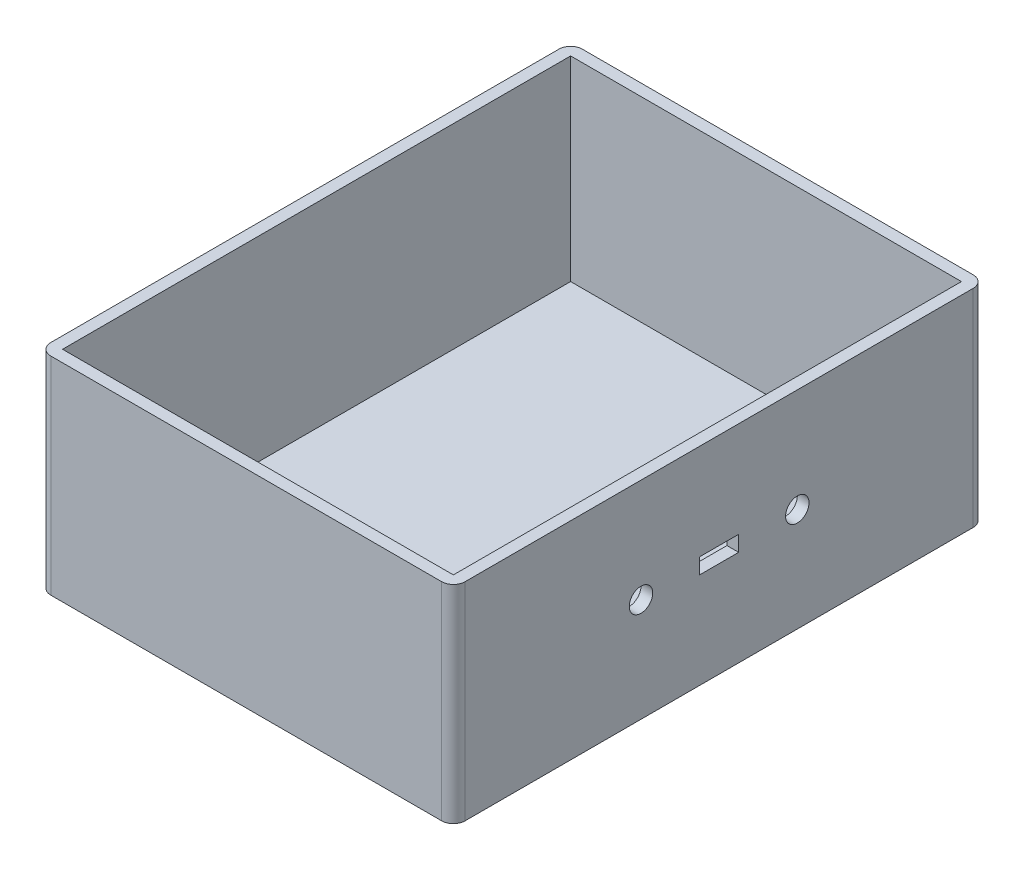
ISO-10303-21;
HEADER;
FILE_DESCRIPTION(('STEP AP214'),'2;1');
FILE_NAME('part.step','',(''),(''),'','','');
FILE_SCHEMA(('AUTOMOTIVE_DESIGN { 1 0 10303 214 1 1 1 1 }'));
ENDSEC;
DATA;
#1=APPLICATION_CONTEXT('core data for automotive mechanical design processes');
#2=APPLICATION_PROTOCOL_DEFINITION('international standard','automotive_design',2000,#1);
#3=PRODUCT_CONTEXT('',#1,'mechanical');
#4=PRODUCT('Part','Part','',(#3));
#5=PRODUCT_RELATED_PRODUCT_CATEGORY('part','',(#4));
#6=PRODUCT_DEFINITION_FORMATION('','',#4);
#7=PRODUCT_DEFINITION_CONTEXT('part definition',#1,'design');
#8=PRODUCT_DEFINITION('design','',#6,#7);
#9=PRODUCT_DEFINITION_SHAPE('','',#8);
#10=(LENGTH_UNIT() NAMED_UNIT(*) SI_UNIT(.MILLI.,.METRE.));
#11=(NAMED_UNIT(*) PLANE_ANGLE_UNIT() SI_UNIT($,.RADIAN.));
#12=(NAMED_UNIT(*) SI_UNIT($,.STERADIAN.) SOLID_ANGLE_UNIT());
#13=UNCERTAINTY_MEASURE_WITH_UNIT(LENGTH_MEASURE(1.E-05),#10,'distance_accuracy_value','');
#14=(GEOMETRIC_REPRESENTATION_CONTEXT(3) GLOBAL_UNCERTAINTY_ASSIGNED_CONTEXT((#13)) GLOBAL_UNIT_ASSIGNED_CONTEXT((#10,
#11,#12)) REPRESENTATION_CONTEXT('',''));
#15=CARTESIAN_POINT('',(0.,0.,0.));
#16=DIRECTION('',(0.,0.,1.));
#17=DIRECTION('',(1.,0.,0.));
#18=AXIS2_PLACEMENT_3D('',#15,#16,#17);
#19=CARTESIAN_POINT('',(0.,50.,0.));
#20=DIRECTION('',(0.,-1.,0.));
#21=DIRECTION('',(0.,0.,-1.));
#22=AXIS2_PLACEMENT_3D('',#19,#20,#21);
#23=PLANE('',#22);
#24=DIRECTION('',(0.,0.,-1.));
#25=VECTOR('',#24,1.);
#26=CARTESIAN_POINT('',(53.,50.,68.));
#27=LINE('',#26,#25);
#28=CARTESIAN_POINT('',(53.,50.,65.));
#29=VERTEX_POINT('',#28);
#30=CARTESIAN_POINT('',(53.,50.,-65.));
#31=VERTEX_POINT('',#30);
#32=EDGE_CURVE('E264',#29,#31,#27,.T.);
#33=ORIENTED_EDGE('',*,*,#32,.T.);
#34=CARTESIAN_POINT('',(50.,50.,-65.));
#35=DIRECTION('',(0.,-1.,0.));
#36=DIRECTION('',(0.,0.,-1.));
#37=AXIS2_PLACEMENT_3D('',#34,#35,#36);
#38=CIRCLE('',#37,3.);
#39=CARTESIAN_POINT('',(50.,50.,-68.));
#40=VERTEX_POINT('',#39);
#41=EDGE_CURVE('E315',#31,#40,#38,.F.);
#42=ORIENTED_EDGE('',*,*,#41,.T.);
#43=DIRECTION('',(-1.,0.,0.));
#44=VECTOR('',#43,1.);
#45=CARTESIAN_POINT('',(-53.,50.,-68.));
#46=LINE('',#45,#44);
#47=CARTESIAN_POINT('',(-50.,50.,-68.));
#48=VERTEX_POINT('',#47);
#49=EDGE_CURVE('E268',#40,#48,#46,.T.);
#50=ORIENTED_EDGE('',*,*,#49,.T.);
#51=CARTESIAN_POINT('',(-50.,50.,-65.));
#52=DIRECTION('',(0.,-1.,0.));
#53=DIRECTION('',(0.,0.,-1.));
#54=AXIS2_PLACEMENT_3D('',#51,#52,#53);
#55=CIRCLE('',#54,3.);
#56=CARTESIAN_POINT('',(-53.,50.,-65.));
#57=VERTEX_POINT('',#56);
#58=EDGE_CURVE('E312',#48,#57,#55,.F.);
#59=ORIENTED_EDGE('',*,*,#58,.T.);
#60=DIRECTION('',(0.,0.,1.));
#61=VECTOR('',#60,1.);
#62=CARTESIAN_POINT('',(-53.,50.,68.));
#63=LINE('',#62,#61);
#64=CARTESIAN_POINT('',(-53.,50.,65.));
#65=VERTEX_POINT('',#64);
#66=EDGE_CURVE('E272',#57,#65,#63,.T.);
#67=ORIENTED_EDGE('',*,*,#66,.T.);
#68=CARTESIAN_POINT('',(-50.,50.,65.));
#69=DIRECTION('',(0.,-1.,0.));
#70=DIRECTION('',(0.,0.,-1.));
#71=AXIS2_PLACEMENT_3D('',#68,#69,#70);
#72=CIRCLE('',#71,3.);
#73=CARTESIAN_POINT('',(-50.,50.,68.));
#74=VERTEX_POINT('',#73);
#75=EDGE_CURVE('E309',#65,#74,#72,.F.);
#76=ORIENTED_EDGE('',*,*,#75,.T.);
#77=DIRECTION('',(1.,0.,0.));
#78=VECTOR('',#77,1.);
#79=CARTESIAN_POINT('',(-53.,50.,68.));
#80=LINE('',#79,#78);
#81=CARTESIAN_POINT('',(50.,50.,68.));
#82=VERTEX_POINT('',#81);
#83=EDGE_CURVE('E276',#74,#82,#80,.T.);
#84=ORIENTED_EDGE('',*,*,#83,.T.);
#85=CARTESIAN_POINT('',(50.,50.,65.));
#86=DIRECTION('',(0.,-1.,0.));
#87=DIRECTION('',(0.,0.,-1.));
#88=AXIS2_PLACEMENT_3D('',#85,#86,#87);
#89=CIRCLE('',#88,3.);
#90=EDGE_CURVE('E306',#82,#29,#89,.F.);
#91=ORIENTED_EDGE('',*,*,#90,.T.);
#92=EDGE_LOOP('',(#33,#42,#50,#59,#67,#76,#84,#91));
#93=FACE_BOUND('',#92,.T.);
#94=DIRECTION('',(0.,0.,-1.));
#95=VECTOR('',#94,1.);
#96=CARTESIAN_POINT('',(50.,50.,-65.));
#97=LINE('',#96,#95);
#98=CARTESIAN_POINT('',(50.,50.,65.));
#99=VERTEX_POINT('',#98);
#100=CARTESIAN_POINT('',(50.,50.,-65.));
#101=VERTEX_POINT('',#100);
#102=EDGE_CURVE('E221',#99,#101,#97,.T.);
#103=ORIENTED_EDGE('',*,*,#102,.F.);
#104=DIRECTION('',(1.,0.,0.));
#105=VECTOR('',#104,1.);
#106=CARTESIAN_POINT('',(-50.,50.,65.));
#107=LINE('',#106,#105);
#108=CARTESIAN_POINT('',(-50.,50.,65.));
#109=VERTEX_POINT('',#108);
#110=EDGE_CURVE('E232',#109,#99,#107,.T.);
#111=ORIENTED_EDGE('',*,*,#110,.F.);
#112=DIRECTION('',(0.,0.,1.));
#113=VECTOR('',#112,1.);
#114=CARTESIAN_POINT('',(-50.,50.,-65.));
#115=LINE('',#114,#113);
#116=CARTESIAN_POINT('',(-50.,50.,-65.));
#117=VERTEX_POINT('',#116);
#118=EDGE_CURVE('E228',#117,#109,#115,.T.);
#119=ORIENTED_EDGE('',*,*,#118,.F.);
#120=DIRECTION('',(-1.,0.,0.));
#121=VECTOR('',#120,1.);
#122=CARTESIAN_POINT('',(-50.,50.,-65.));
#123=LINE('',#122,#121);
#124=EDGE_CURVE('E224',#101,#117,#123,.T.);
#125=ORIENTED_EDGE('',*,*,#124,.F.);
#126=EDGE_LOOP('',(#103,#111,#119,#125));
#127=FACE_BOUND('',#126,.T.);
#128=ADVANCED_FACE('F38',(#93,#127),#23,.F.);
#129=CARTESIAN_POINT('',(53.,50.,68.));
#130=DIRECTION('',(-1.,0.,0.));
#131=DIRECTION('',(0.,0.,1.));
#132=AXIS2_PLACEMENT_3D('',#129,#130,#131);
#133=PLANE('',#132);
#134=CARTESIAN_POINT('',(53.,23.5,20.));
#135=DIRECTION('',(1.,0.,0.));
#136=DIRECTION('',(0.,0.,-1.));
#137=AXIS2_PLACEMENT_3D('',#134,#135,#136);
#138=CIRCLE('',#137,3.);
#139=CARTESIAN_POINT('',(53.,23.5,17.));
#140=VERTEX_POINT('',#139);
#141=EDGE_CURVE('E434',#140,#140,#138,.T.);
#142=ORIENTED_EDGE('',*,*,#141,.F.);
#143=EDGE_LOOP('',(#142));
#144=FACE_BOUND('',#143,.T.);
#145=CARTESIAN_POINT('',(53.,23.5,-20.));
#146=DIRECTION('',(1.,0.,0.));
#147=DIRECTION('',(0.,0.,-1.));
#148=AXIS2_PLACEMENT_3D('',#145,#146,#147);
#149=CIRCLE('',#148,3.);
#150=CARTESIAN_POINT('',(53.,23.5,-23.));
#151=VERTEX_POINT('',#150);
#152=EDGE_CURVE('E180',#151,#151,#149,.T.);
#153=ORIENTED_EDGE('',*,*,#152,.F.);
#154=EDGE_LOOP('',(#153));
#155=FACE_BOUND('',#154,.T.);
#156=DIRECTION('',(0.,0.,1.));
#157=VECTOR('',#156,1.);
#158=CARTESIAN_POINT('',(53.,25.5,5.00000000000001));
#159=LINE('',#158,#157);
#160=CARTESIAN_POINT('',(53.,25.5,-4.99999999999999));
#161=VERTEX_POINT('',#160);
#162=CARTESIAN_POINT('',(53.,25.5,5.00000000000001));
#163=VERTEX_POINT('',#162);
#164=EDGE_CURVE('E189',#161,#163,#159,.T.);
#165=ORIENTED_EDGE('',*,*,#164,.F.);
#166=DIRECTION('',(0.,1.,0.));
#167=VECTOR('',#166,1.);
#168=CARTESIAN_POINT('',(53.,21.5,-4.99999999999999));
#169=LINE('',#168,#167);
#170=CARTESIAN_POINT('',(53.,21.5,-4.99999999999999));
#171=VERTEX_POINT('',#170);
#172=EDGE_CURVE('E54',#171,#161,#169,.T.);
#173=ORIENTED_EDGE('',*,*,#172,.F.);
#174=DIRECTION('',(0.,0.,-1.));
#175=VECTOR('',#174,1.);
#176=CARTESIAN_POINT('',(53.,21.5,5.00000000000001));
#177=LINE('',#176,#175);
#178=CARTESIAN_POINT('',(53.,21.5,5.00000000000001));
#179=VERTEX_POINT('',#178);
#180=EDGE_CURVE('E173',#179,#171,#177,.T.);
#181=ORIENTED_EDGE('',*,*,#180,.F.);
#182=DIRECTION('',(0.,-1.,0.));
#183=VECTOR('',#182,1.);
#184=CARTESIAN_POINT('',(53.,21.5,5.00000000000001));
#185=LINE('',#184,#183);
#186=EDGE_CURVE('E177',#163,#179,#185,.T.);
#187=ORIENTED_EDGE('',*,*,#186,.F.);
#188=EDGE_LOOP('',(#165,#173,#181,#187));
#189=FACE_BOUND('',#188,.T.);
#190=DIRECTION('',(0.,0.,1.));
#191=VECTOR('',#190,1.);
#192=CARTESIAN_POINT('',(53.,-3.,-68.));
#193=LINE('',#192,#191);
#194=CARTESIAN_POINT('',(53.,-3.,-65.));
#195=VERTEX_POINT('',#194);
#196=CARTESIAN_POINT('',(53.,-3.,65.));
#197=VERTEX_POINT('',#196);
#198=EDGE_CURVE('E203',#195,#197,#193,.T.);
#199=ORIENTED_EDGE('',*,*,#198,.F.);
#200=DIRECTION('',(0.,-1.,0.));
#201=VECTOR('',#200,1.);
#202=CARTESIAN_POINT('',(53.,50.,-65.));
#203=LINE('',#202,#201);
#204=EDGE_CURVE('E303',#195,#31,#203,.F.);
#205=ORIENTED_EDGE('',*,*,#204,.T.);
#206=ORIENTED_EDGE('',*,*,#32,.F.);
#207=DIRECTION('',(0.,-1.,0.));
#208=VECTOR('',#207,1.);
#209=CARTESIAN_POINT('',(53.,50.,65.));
#210=LINE('',#209,#208);
#211=EDGE_CURVE('E299',#29,#197,#210,.T.);
#212=ORIENTED_EDGE('',*,*,#211,.T.);
#213=EDGE_LOOP('',(#199,#205,#206,#212));
#214=FACE_BOUND('',#213,.T.);
#215=ADVANCED_FACE('F340',(#144,#155,#189,#214),#133,.F.);
#216=CARTESIAN_POINT('',(-53.,50.,-68.));
#217=DIRECTION('',(0.,0.,1.));
#218=DIRECTION('',(1.,0.,0.));
#219=AXIS2_PLACEMENT_3D('',#216,#217,#218);
#220=PLANE('',#219);
#221=ORIENTED_EDGE('',*,*,#49,.F.);
#222=DIRECTION('',(0.,-1.,0.));
#223=VECTOR('',#222,1.);
#224=CARTESIAN_POINT('',(50.,50.,-68.));
#225=LINE('',#224,#223);
#226=CARTESIAN_POINT('',(50.,-3.,-68.));
#227=VERTEX_POINT('',#226);
#228=EDGE_CURVE('E283',#40,#227,#225,.T.);
#229=ORIENTED_EDGE('',*,*,#228,.T.);
#230=DIRECTION('',(1.,0.,0.));
#231=VECTOR('',#230,1.);
#232=CARTESIAN_POINT('',(53.,-3.,-68.));
#233=LINE('',#232,#231);
#234=CARTESIAN_POINT('',(-50.,-3.,-68.));
#235=VERTEX_POINT('',#234);
#236=EDGE_CURVE('E216',#235,#227,#233,.T.);
#237=ORIENTED_EDGE('',*,*,#236,.F.);
#238=DIRECTION('',(0.,-1.,0.));
#239=VECTOR('',#238,1.);
#240=CARTESIAN_POINT('',(-50.,50.,-68.));
#241=LINE('',#240,#239);
#242=EDGE_CURVE('E280',#235,#48,#241,.F.);
#243=ORIENTED_EDGE('',*,*,#242,.T.);
#244=EDGE_LOOP('',(#221,#229,#237,#243));
#245=FACE_BOUND('',#244,.T.);
#246=ADVANCED_FACE('F351',(#245),#220,.F.);
#247=CARTESIAN_POINT('',(-53.,50.,68.));
#248=DIRECTION('',(1.,0.,0.));
#249=DIRECTION('',(0.,0.,-1.));
#250=AXIS2_PLACEMENT_3D('',#247,#248,#249);
#251=PLANE('',#250);
#252=ORIENTED_EDGE('',*,*,#66,.F.);
#253=DIRECTION('',(0.,-1.,0.));
#254=VECTOR('',#253,1.);
#255=CARTESIAN_POINT('',(-53.,50.,-65.));
#256=LINE('',#255,#254);
#257=CARTESIAN_POINT('',(-53.,-3.,-65.));
#258=VERTEX_POINT('',#257);
#259=EDGE_CURVE('E321',#57,#258,#256,.T.);
#260=ORIENTED_EDGE('',*,*,#259,.T.);
#261=DIRECTION('',(0.,0.,-1.));
#262=VECTOR('',#261,1.);
#263=CARTESIAN_POINT('',(-53.,-3.,-68.));
#264=LINE('',#263,#262);
#265=CARTESIAN_POINT('',(-53.,-3.,65.));
#266=VERTEX_POINT('',#265);
#267=EDGE_CURVE('E212',#266,#258,#264,.T.);
#268=ORIENTED_EDGE('',*,*,#267,.F.);
#269=DIRECTION('',(0.,-1.,0.));
#270=VECTOR('',#269,1.);
#271=CARTESIAN_POINT('',(-53.,50.,65.));
#272=LINE('',#271,#270);
#273=EDGE_CURVE('E318',#266,#65,#272,.F.);
#274=ORIENTED_EDGE('',*,*,#273,.T.);
#275=EDGE_LOOP('',(#252,#260,#268,#274));
#276=FACE_BOUND('',#275,.T.);
#277=ADVANCED_FACE('F360',(#276),#251,.F.);
#278=CARTESIAN_POINT('',(-53.,50.,68.));
#279=DIRECTION('',(0.,0.,-1.));
#280=DIRECTION('',(-1.,0.,0.));
#281=AXIS2_PLACEMENT_3D('',#278,#279,#280);
#282=PLANE('',#281);
#283=ORIENTED_EDGE('',*,*,#83,.F.);
#284=DIRECTION('',(0.,-1.,0.));
#285=VECTOR('',#284,1.);
#286=CARTESIAN_POINT('',(-50.,50.,68.));
#287=LINE('',#286,#285);
#288=CARTESIAN_POINT('',(-50.,-3.,68.));
#289=VERTEX_POINT('',#288);
#290=EDGE_CURVE('E11',#74,#289,#287,.T.);
#291=ORIENTED_EDGE('',*,*,#290,.T.);
#292=DIRECTION('',(-1.,0.,0.));
#293=VECTOR('',#292,1.);
#294=CARTESIAN_POINT('',(53.,-3.,68.));
#295=LINE('',#294,#293);
#296=CARTESIAN_POINT('',(50.,-3.,68.));
#297=VERTEX_POINT('',#296);
#298=EDGE_CURVE('E207',#297,#289,#295,.T.);
#299=ORIENTED_EDGE('',*,*,#298,.F.);
#300=DIRECTION('',(0.,-1.,0.));
#301=VECTOR('',#300,1.);
#302=CARTESIAN_POINT('',(50.,50.,68.));
#303=LINE('',#302,#301);
#304=EDGE_CURVE('E47',#297,#82,#303,.F.);
#305=ORIENTED_EDGE('',*,*,#304,.T.);
#306=EDGE_LOOP('',(#283,#291,#299,#305));
#307=FACE_BOUND('',#306,.T.);
#308=ADVANCED_FACE('F329',(#307),#282,.F.);
#309=CARTESIAN_POINT('',(50.,50.,-65.));
#310=DIRECTION('',(-1.,0.,0.));
#311=DIRECTION('',(0.,0.,1.));
#312=AXIS2_PLACEMENT_3D('',#309,#310,#311);
#313=PLANE('',#312);
#314=CARTESIAN_POINT('',(50.,23.5,20.));
#315=DIRECTION('',(1.,0.,0.));
#316=DIRECTION('',(0.,0.,-1.));
#317=AXIS2_PLACEMENT_3D('',#314,#315,#316);
#318=CIRCLE('',#317,3.);
#319=CARTESIAN_POINT('',(50.,23.5,17.));
#320=VERTEX_POINT('',#319);
#321=EDGE_CURVE('E208',#320,#320,#318,.T.);
#322=ORIENTED_EDGE('',*,*,#321,.T.);
#323=EDGE_LOOP('',(#322));
#324=FACE_BOUND('',#323,.T.);
#325=CARTESIAN_POINT('',(50.,23.5,-20.));
#326=DIRECTION('',(1.,0.,0.));
#327=DIRECTION('',(0.,0.,-1.));
#328=AXIS2_PLACEMENT_3D('',#325,#326,#327);
#329=CIRCLE('',#328,3.);
#330=CARTESIAN_POINT('',(50.,23.5,-23.));
#331=VERTEX_POINT('',#330);
#332=EDGE_CURVE('E431',#331,#331,#329,.T.);
#333=ORIENTED_EDGE('',*,*,#332,.T.);
#334=EDGE_LOOP('',(#333));
#335=FACE_BOUND('',#334,.T.);
#336=DIRECTION('',(0.,1.,0.));
#337=VECTOR('',#336,1.);
#338=CARTESIAN_POINT('',(50.,21.5,-4.99999999999999));
#339=LINE('',#338,#337);
#340=CARTESIAN_POINT('',(50.,21.5,-4.99999999999999));
#341=VERTEX_POINT('',#340);
#342=CARTESIAN_POINT('',(50.,25.5,-4.99999999999999));
#343=VERTEX_POINT('',#342);
#344=EDGE_CURVE('E154',#341,#343,#339,.T.);
#345=ORIENTED_EDGE('',*,*,#344,.T.);
#346=DIRECTION('',(0.,0.,1.));
#347=VECTOR('',#346,1.);
#348=CARTESIAN_POINT('',(50.,25.5,5.00000000000001));
#349=LINE('',#348,#347);
#350=CARTESIAN_POINT('',(50.,25.5,5.));
#351=VERTEX_POINT('',#350);
#352=EDGE_CURVE('E164',#343,#351,#349,.T.);
#353=ORIENTED_EDGE('',*,*,#352,.T.);
#354=DIRECTION('',(0.,-1.,0.));
#355=VECTOR('',#354,1.);
#356=CARTESIAN_POINT('',(50.,21.5,5.00000000000001));
#357=LINE('',#356,#355);
#358=CARTESIAN_POINT('',(50.,21.5,5.00000000000001));
#359=VERTEX_POINT('',#358);
#360=EDGE_CURVE('E62',#351,#359,#357,.T.);
#361=ORIENTED_EDGE('',*,*,#360,.T.);
#362=DIRECTION('',(0.,0.,-1.));
#363=VECTOR('',#362,1.);
#364=CARTESIAN_POINT('',(50.,21.5,5.00000000000001));
#365=LINE('',#364,#363);
#366=EDGE_CURVE('E161',#359,#341,#365,.T.);
#367=ORIENTED_EDGE('',*,*,#366,.T.);
#368=EDGE_LOOP('',(#345,#353,#361,#367));
#369=FACE_BOUND('',#368,.T.);
#370=DIRECTION('',(0.,0.,-1.));
#371=VECTOR('',#370,1.);
#372=CARTESIAN_POINT('',(50.,0.,-65.));
#373=LINE('',#372,#371);
#374=CARTESIAN_POINT('',(50.,0.,65.));
#375=VERTEX_POINT('',#374);
#376=CARTESIAN_POINT('',(50.,0.,-65.));
#377=VERTEX_POINT('',#376);
#378=EDGE_CURVE('E220',#375,#377,#373,.T.);
#379=ORIENTED_EDGE('',*,*,#378,.F.);
#380=DIRECTION('',(0.,-1.,0.));
#381=VECTOR('',#380,1.);
#382=CARTESIAN_POINT('',(50.,50.,65.));
#383=LINE('',#382,#381);
#384=EDGE_CURVE('E235',#99,#375,#383,.T.);
#385=ORIENTED_EDGE('',*,*,#384,.F.);
#386=ORIENTED_EDGE('',*,*,#102,.T.);
#387=DIRECTION('',(0.,-1.,0.));
#388=VECTOR('',#387,1.);
#389=CARTESIAN_POINT('',(50.,50.,-65.));
#390=LINE('',#389,#388);
#391=EDGE_CURVE('E260',#101,#377,#390,.T.);
#392=ORIENTED_EDGE('',*,*,#391,.T.);
#393=EDGE_LOOP('',(#379,#385,#386,#392));
#394=FACE_BOUND('',#393,.T.);
#395=ADVANCED_FACE('F169',(#324,#335,#369,#394),#313,.T.);
#396=CARTESIAN_POINT('',(-50.,50.,-65.));
#397=DIRECTION('',(0.,0.,1.));
#398=DIRECTION('',(1.,0.,0.));
#399=AXIS2_PLACEMENT_3D('',#396,#397,#398);
#400=PLANE('',#399);
#401=DIRECTION('',(-1.,0.,0.));
#402=VECTOR('',#401,1.);
#403=CARTESIAN_POINT('',(-50.,0.,-65.));
#404=LINE('',#403,#402);
#405=CARTESIAN_POINT('',(-50.,0.,-65.));
#406=VERTEX_POINT('',#405);
#407=EDGE_CURVE('E239',#377,#406,#404,.T.);
#408=ORIENTED_EDGE('',*,*,#407,.F.);
#409=ORIENTED_EDGE('',*,*,#391,.F.);
#410=ORIENTED_EDGE('',*,*,#124,.T.);
#411=DIRECTION('',(0.,-1.,0.));
#412=VECTOR('',#411,1.);
#413=CARTESIAN_POINT('',(-50.,50.,-65.));
#414=LINE('',#413,#412);
#415=EDGE_CURVE('E257',#117,#406,#414,.T.);
#416=ORIENTED_EDGE('',*,*,#415,.T.);
#417=EDGE_LOOP('',(#408,#409,#410,#416));
#418=FACE_BOUND('',#417,.T.);
#419=ADVANCED_FACE('F407',(#418),#400,.T.);
#420=CARTESIAN_POINT('',(-50.,50.,-65.));
#421=DIRECTION('',(1.,0.,0.));
#422=DIRECTION('',(0.,0.,-1.));
#423=AXIS2_PLACEMENT_3D('',#420,#421,#422);
#424=PLANE('',#423);
#425=DIRECTION('',(0.,0.,1.));
#426=VECTOR('',#425,1.);
#427=CARTESIAN_POINT('',(-50.,0.,-65.));
#428=LINE('',#427,#426);
#429=CARTESIAN_POINT('',(-50.,0.,65.));
#430=VERTEX_POINT('',#429);
#431=EDGE_CURVE('E243',#406,#430,#428,.T.);
#432=ORIENTED_EDGE('',*,*,#431,.F.);
#433=ORIENTED_EDGE('',*,*,#415,.F.);
#434=ORIENTED_EDGE('',*,*,#118,.T.);
#435=DIRECTION('',(0.,-1.,0.));
#436=VECTOR('',#435,1.);
#437=CARTESIAN_POINT('',(-50.,50.,65.));
#438=LINE('',#437,#436);
#439=EDGE_CURVE('E253',#109,#430,#438,.T.);
#440=ORIENTED_EDGE('',*,*,#439,.T.);
#441=EDGE_LOOP('',(#432,#433,#434,#440));
#442=FACE_BOUND('',#441,.T.);
#443=ADVANCED_FACE('F404',(#442),#424,.T.);
#444=CARTESIAN_POINT('',(-50.,50.,65.));
#445=DIRECTION('',(0.,0.,-1.));
#446=DIRECTION('',(-1.,0.,0.));
#447=AXIS2_PLACEMENT_3D('',#444,#445,#446);
#448=PLANE('',#447);
#449=DIRECTION('',(1.,0.,0.));
#450=VECTOR('',#449,1.);
#451=CARTESIAN_POINT('',(-50.,0.,65.));
#452=LINE('',#451,#450);
#453=EDGE_CURVE('E225',#430,#375,#452,.T.);
#454=ORIENTED_EDGE('',*,*,#453,.F.);
#455=ORIENTED_EDGE('',*,*,#439,.F.);
#456=ORIENTED_EDGE('',*,*,#110,.T.);
#457=ORIENTED_EDGE('',*,*,#384,.T.);
#458=EDGE_LOOP('',(#454,#455,#456,#457));
#459=FACE_BOUND('',#458,.T.);
#460=ADVANCED_FACE('F396',(#459),#448,.T.);
#461=CARTESIAN_POINT('',(0.,0.,0.));
#462=DIRECTION('',(0.,-1.,0.));
#463=DIRECTION('',(0.,0.,-1.));
#464=AXIS2_PLACEMENT_3D('',#461,#462,#463);
#465=PLANE('',#464);
#466=ORIENTED_EDGE('',*,*,#431,.T.);
#467=ORIENTED_EDGE('',*,*,#453,.T.);
#468=ORIENTED_EDGE('',*,*,#378,.T.);
#469=ORIENTED_EDGE('',*,*,#407,.T.);
#470=EDGE_LOOP('',(#466,#467,#468,#469));
#471=FACE_BOUND('',#470,.T.);
#472=ADVANCED_FACE('F391',(#471),#465,.F.);
#473=CARTESIAN_POINT('',(0.,-3.,0.));
#474=DIRECTION('',(0.,-1.,0.));
#475=DIRECTION('',(0.,0.,-1.));
#476=AXIS2_PLACEMENT_3D('',#473,#474,#475);
#477=PLANE('',#476);
#478=ORIENTED_EDGE('',*,*,#236,.T.);
#479=CARTESIAN_POINT('',(50.,-3.,-65.));
#480=DIRECTION('',(0.,-1.,0.));
#481=DIRECTION('',(0.,0.,-1.));
#482=AXIS2_PLACEMENT_3D('',#479,#480,#481);
#483=CIRCLE('',#482,3.);
#484=EDGE_CURVE('E296',#227,#195,#483,.T.);
#485=ORIENTED_EDGE('',*,*,#484,.T.);
#486=ORIENTED_EDGE('',*,*,#198,.T.);
#487=CARTESIAN_POINT('',(50.,-3.,65.));
#488=DIRECTION('',(0.,-1.,0.));
#489=DIRECTION('',(0.,0.,-1.));
#490=AXIS2_PLACEMENT_3D('',#487,#488,#489);
#491=CIRCLE('',#490,3.);
#492=EDGE_CURVE('E287',#197,#297,#491,.T.);
#493=ORIENTED_EDGE('',*,*,#492,.T.);
#494=ORIENTED_EDGE('',*,*,#298,.T.);
#495=CARTESIAN_POINT('',(-50.,-3.,65.));
#496=DIRECTION('',(0.,-1.,0.));
#497=DIRECTION('',(0.,0.,-1.));
#498=AXIS2_PLACEMENT_3D('',#495,#496,#497);
#499=CIRCLE('',#498,3.);
#500=EDGE_CURVE('E290',#289,#266,#499,.T.);
#501=ORIENTED_EDGE('',*,*,#500,.T.);
#502=ORIENTED_EDGE('',*,*,#267,.T.);
#503=CARTESIAN_POINT('',(-50.,-3.,-65.));
#504=DIRECTION('',(0.,-1.,0.));
#505=DIRECTION('',(0.,0.,-1.));
#506=AXIS2_PLACEMENT_3D('',#503,#504,#505);
#507=CIRCLE('',#506,3.);
#508=EDGE_CURVE('E293',#258,#235,#507,.T.);
#509=ORIENTED_EDGE('',*,*,#508,.T.);
#510=EDGE_LOOP('',(#478,#485,#486,#493,#494,#501,#502,#509));
#511=FACE_BOUND('',#510,.T.);
#512=ADVANCED_FACE('F343',(#511),#477,.T.);
#513=CARTESIAN_POINT('',(50.,50.,-65.));
#514=DIRECTION('',(0.,-1.,0.));
#515=DIRECTION('',(0.,0.,-1.));
#516=AXIS2_PLACEMENT_3D('',#513,#514,#515);
#517=CYLINDRICAL_SURFACE('',#516,3.);
#518=ORIENTED_EDGE('',*,*,#41,.F.);
#519=ORIENTED_EDGE('',*,*,#204,.F.);
#520=ORIENTED_EDGE('',*,*,#484,.F.);
#521=ORIENTED_EDGE('',*,*,#228,.F.);
#522=EDGE_LOOP('',(#518,#519,#520,#521));
#523=FACE_BOUND('',#522,.T.);
#524=ADVANCED_FACE('F348',(#523),#517,.T.);
#525=CARTESIAN_POINT('',(-50.,50.,-65.));
#526=DIRECTION('',(0.,-1.,0.));
#527=DIRECTION('',(0.,0.,-1.));
#528=AXIS2_PLACEMENT_3D('',#525,#526,#527);
#529=CYLINDRICAL_SURFACE('',#528,3.);
#530=ORIENTED_EDGE('',*,*,#58,.F.);
#531=ORIENTED_EDGE('',*,*,#242,.F.);
#532=ORIENTED_EDGE('',*,*,#508,.F.);
#533=ORIENTED_EDGE('',*,*,#259,.F.);
#534=EDGE_LOOP('',(#530,#531,#532,#533));
#535=FACE_BOUND('',#534,.T.);
#536=ADVANCED_FACE('F357',(#535),#529,.T.);
#537=CARTESIAN_POINT('',(-50.,50.,65.));
#538=DIRECTION('',(0.,-1.,0.));
#539=DIRECTION('',(0.,0.,-1.));
#540=AXIS2_PLACEMENT_3D('',#537,#538,#539);
#541=CYLINDRICAL_SURFACE('',#540,3.);
#542=ORIENTED_EDGE('',*,*,#75,.F.);
#543=ORIENTED_EDGE('',*,*,#273,.F.);
#544=ORIENTED_EDGE('',*,*,#500,.F.);
#545=ORIENTED_EDGE('',*,*,#290,.F.);
#546=EDGE_LOOP('',(#542,#543,#544,#545));
#547=FACE_BOUND('',#546,.T.);
#548=ADVANCED_FACE('F363',(#547),#541,.T.);
#549=CARTESIAN_POINT('',(50.,50.,65.));
#550=DIRECTION('',(0.,-1.,0.));
#551=DIRECTION('',(0.,0.,-1.));
#552=AXIS2_PLACEMENT_3D('',#549,#550,#551);
#553=CYLINDRICAL_SURFACE('',#552,3.);
#554=ORIENTED_EDGE('',*,*,#90,.F.);
#555=ORIENTED_EDGE('',*,*,#304,.F.);
#556=ORIENTED_EDGE('',*,*,#492,.F.);
#557=ORIENTED_EDGE('',*,*,#211,.F.);
#558=EDGE_LOOP('',(#554,#555,#556,#557));
#559=FACE_BOUND('',#558,.T.);
#560=ADVANCED_FACE('F40',(#559),#553,.T.);
#561=CARTESIAN_POINT('',(50.,21.5,-4.99999999999999));
#562=DIRECTION('',(0.,0.,-1.));
#563=DIRECTION('',(-1.,0.,0.));
#564=AXIS2_PLACEMENT_3D('',#561,#562,#563);
#565=PLANE('',#564);
#566=ORIENTED_EDGE('',*,*,#172,.T.);
#567=DIRECTION('',(1.,0.,0.));
#568=VECTOR('',#567,1.);
#569=CARTESIAN_POINT('',(50.,25.5,-4.99999999999999));
#570=LINE('',#569,#568);
#571=EDGE_CURVE('E150',#343,#161,#570,.T.);
#572=ORIENTED_EDGE('',*,*,#571,.F.);
#573=ORIENTED_EDGE('',*,*,#344,.F.);
#574=DIRECTION('',(1.,0.,0.));
#575=VECTOR('',#574,1.);
#576=CARTESIAN_POINT('',(50.,21.5,-4.99999999999999));
#577=LINE('',#576,#575);
#578=EDGE_CURVE('E195',#341,#171,#577,.T.);
#579=ORIENTED_EDGE('',*,*,#578,.T.);
#580=EDGE_LOOP('',(#566,#572,#573,#579));
#581=FACE_BOUND('',#580,.T.);
#582=ADVANCED_FACE('F152',(#581),#565,.F.);
#583=CARTESIAN_POINT('',(50.,21.5,5.00000000000001));
#584=DIRECTION('',(0.,-1.,0.));
#585=DIRECTION('',(0.,0.,-1.));
#586=AXIS2_PLACEMENT_3D('',#583,#584,#585);
#587=PLANE('',#586);
#588=ORIENTED_EDGE('',*,*,#180,.T.);
#589=ORIENTED_EDGE('',*,*,#578,.F.);
#590=ORIENTED_EDGE('',*,*,#366,.F.);
#591=DIRECTION('',(1.,0.,0.));
#592=VECTOR('',#591,1.);
#593=CARTESIAN_POINT('',(50.,21.5,5.00000000000001));
#594=LINE('',#593,#592);
#595=EDGE_CURVE('E198',#359,#179,#594,.T.);
#596=ORIENTED_EDGE('',*,*,#595,.T.);
#597=EDGE_LOOP('',(#588,#589,#590,#596));
#598=FACE_BOUND('',#597,.T.);
#599=ADVANCED_FACE('F451',(#598),#587,.F.);
#600=CARTESIAN_POINT('',(50.,21.5,5.00000000000001));
#601=DIRECTION('',(0.,0.,1.));
#602=DIRECTION('',(1.,0.,0.));
#603=AXIS2_PLACEMENT_3D('',#600,#601,#602);
#604=PLANE('',#603);
#605=ORIENTED_EDGE('',*,*,#186,.T.);
#606=ORIENTED_EDGE('',*,*,#595,.F.);
#607=ORIENTED_EDGE('',*,*,#360,.F.);
#608=DIRECTION('',(1.,0.,0.));
#609=VECTOR('',#608,1.);
#610=CARTESIAN_POINT('',(50.,25.5,5.00000000000001));
#611=LINE('',#610,#609);
#612=EDGE_CURVE('E160',#351,#163,#611,.T.);
#613=ORIENTED_EDGE('',*,*,#612,.T.);
#614=EDGE_LOOP('',(#605,#606,#607,#613));
#615=FACE_BOUND('',#614,.T.);
#616=ADVANCED_FACE('F449',(#615),#604,.F.);
#617=CARTESIAN_POINT('',(50.,25.5,5.00000000000001));
#618=DIRECTION('',(0.,1.,0.));
#619=DIRECTION('',(0.,0.,1.));
#620=AXIS2_PLACEMENT_3D('',#617,#618,#619);
#621=PLANE('',#620);
#622=ORIENTED_EDGE('',*,*,#164,.T.);
#623=ORIENTED_EDGE('',*,*,#612,.F.);
#624=ORIENTED_EDGE('',*,*,#352,.F.);
#625=ORIENTED_EDGE('',*,*,#571,.T.);
#626=EDGE_LOOP('',(#622,#623,#624,#625));
#627=FACE_BOUND('',#626,.T.);
#628=ADVANCED_FACE('F165',(#627),#621,.F.);
#629=CARTESIAN_POINT('',(50.,23.5,-20.));
#630=DIRECTION('',(1.,0.,0.));
#631=DIRECTION('',(0.,0.,-1.));
#632=AXIS2_PLACEMENT_3D('',#629,#630,#631);
#633=CYLINDRICAL_SURFACE('',#632,3.);
#634=ORIENTED_EDGE('',*,*,#332,.F.);
#635=EDGE_LOOP('',(#634));
#636=FACE_BOUND('',#635,.T.);
#637=ORIENTED_EDGE('',*,*,#152,.T.);
#638=EDGE_LOOP('',(#637));
#639=FACE_BOUND('',#638,.T.);
#640=ADVANCED_FACE('F444',(#636,#639),#633,.F.);
#641=CARTESIAN_POINT('',(50.,23.5,20.));
#642=DIRECTION('',(1.,0.,0.));
#643=DIRECTION('',(0.,0.,-1.));
#644=AXIS2_PLACEMENT_3D('',#641,#642,#643);
#645=CYLINDRICAL_SURFACE('',#644,3.);
#646=ORIENTED_EDGE('',*,*,#321,.F.);
#647=EDGE_LOOP('',(#646));
#648=FACE_BOUND('',#647,.T.);
#649=ORIENTED_EDGE('',*,*,#141,.T.);
#650=EDGE_LOOP('',(#649));
#651=FACE_BOUND('',#650,.T.);
#652=ADVANCED_FACE('F465',(#648,#651),#645,.F.);
#653=CLOSED_SHELL('',(#128,#215,#246,#277,#308,#395,#419,#443,#460,#472,#512,#524,#536,#548,
#560,#582,#599,#616,#628,#640,#652));
#654=MANIFOLD_SOLID_BREP('B2',#653);
#655=ADVANCED_BREP_SHAPE_REPRESENTATION('',(#18,#654),#14);
#656=SHAPE_DEFINITION_REPRESENTATION(#9,#655);
ENDSEC;
END-ISO-10303-21;
